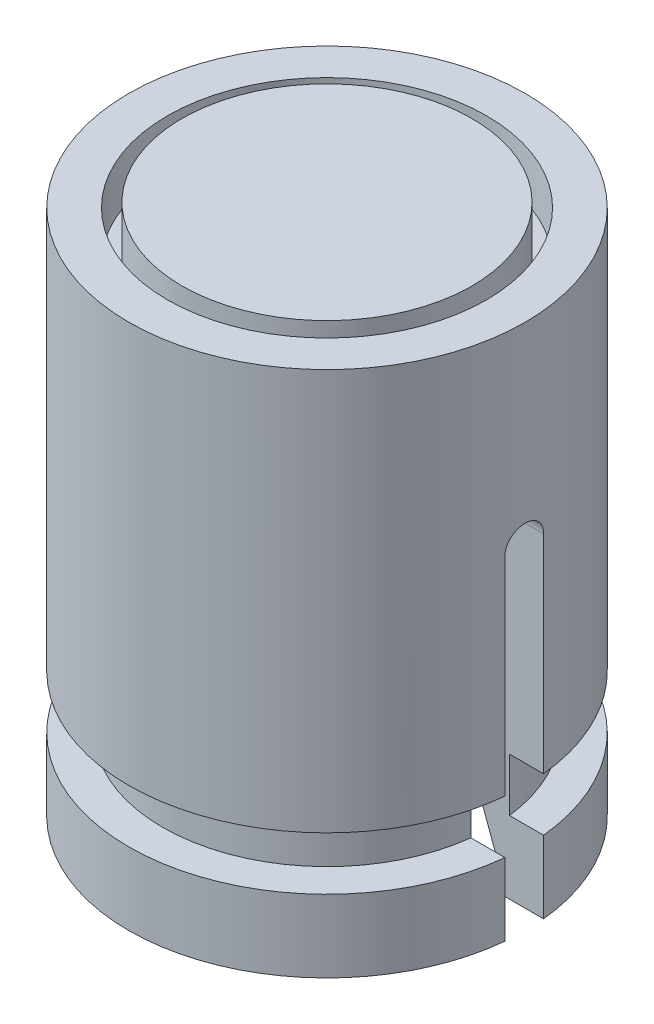
ISO-10303-21;
HEADER;
FILE_DESCRIPTION(('STEP AP214'),'2;1');
FILE_NAME('part.step','',(''),(''),'','','');
FILE_SCHEMA(('AUTOMOTIVE_DESIGN { 1 0 10303 214 1 1 1 1 }'));
ENDSEC;
DATA;
#1=APPLICATION_CONTEXT('core data for automotive mechanical design processes');
#2=APPLICATION_PROTOCOL_DEFINITION('international standard','automotive_design',2000,#1);
#3=PRODUCT_CONTEXT('',#1,'mechanical');
#4=PRODUCT('Part','Part','',(#3));
#5=PRODUCT_RELATED_PRODUCT_CATEGORY('part','',(#4));
#6=PRODUCT_DEFINITION_FORMATION('','',#4);
#7=PRODUCT_DEFINITION_CONTEXT('part definition',#1,'design');
#8=PRODUCT_DEFINITION('design','',#6,#7);
#9=PRODUCT_DEFINITION_SHAPE('','',#8);
#10=(LENGTH_UNIT() NAMED_UNIT(*) SI_UNIT(.MILLI.,.METRE.));
#11=(NAMED_UNIT(*) PLANE_ANGLE_UNIT() SI_UNIT($,.RADIAN.));
#12=(NAMED_UNIT(*) SI_UNIT($,.STERADIAN.) SOLID_ANGLE_UNIT());
#13=UNCERTAINTY_MEASURE_WITH_UNIT(LENGTH_MEASURE(1.E-05),#10,'distance_accuracy_value','');
#14=(GEOMETRIC_REPRESENTATION_CONTEXT(3) GLOBAL_UNCERTAINTY_ASSIGNED_CONTEXT((#13)) GLOBAL_UNIT_ASSIGNED_CONTEXT((#10,
#11,#12)) REPRESENTATION_CONTEXT('',''));
#15=CARTESIAN_POINT('',(0.,0.,0.));
#16=DIRECTION('',(0.,0.,1.));
#17=DIRECTION('',(1.,0.,0.));
#18=AXIS2_PLACEMENT_3D('',#15,#16,#17);
#19=CARTESIAN_POINT('',(0.,2.6,4.09999999999996));
#20=DIRECTION('',(0.,-1.,0.));
#21=DIRECTION('',(0.,0.,-1.));
#22=AXIS2_PLACEMENT_3D('',#19,#20,#21);
#23=PLANE('',#22);
#24=DIRECTION('',(-1.,0.,0.));
#25=VECTOR('',#24,1.);
#26=CARTESIAN_POINT('',(0.,2.6,0.4));
#27=LINE('',#26,#25);
#28=CARTESIAN_POINT('',(4.08044115262059,2.6,0.4));
#29=VERTEX_POINT('',#28);
#30=CARTESIAN_POINT('',(3.37638860322679,2.6,0.400000000000001));
#31=VERTEX_POINT('',#30);
#32=EDGE_CURVE('E293',#29,#31,#27,.T.);
#33=ORIENTED_EDGE('',*,*,#32,.F.);
#34=CARTESIAN_POINT('',(0.,2.6,0.));
#35=DIRECTION('',(0.,1.,0.));
#36=DIRECTION('',(0.,0.,1.));
#37=AXIS2_PLACEMENT_3D('',#34,#35,#36);
#38=CIRCLE('',#37,4.09999999999996);
#39=CARTESIAN_POINT('',(-4.08044115262059,2.6,0.4));
#40=VERTEX_POINT('',#39);
#41=EDGE_CURVE('E353',#40,#29,#38,.T.);
#42=ORIENTED_EDGE('',*,*,#41,.F.);
#43=CARTESIAN_POINT('',(-3.37638860322679,2.6,0.400000000000001));
#44=VERTEX_POINT('',#43);
#45=EDGE_CURVE('E290',#44,#40,#27,.T.);
#46=ORIENTED_EDGE('',*,*,#45,.F.);
#47=CARTESIAN_POINT('',(0.,2.6,0.));
#48=DIRECTION('',(0.,1.,0.));
#49=DIRECTION('',(0.,0.,1.));
#50=AXIS2_PLACEMENT_3D('',#47,#48,#49);
#51=CIRCLE('',#50,3.39999999999996);
#52=EDGE_CURVE('E349',#44,#31,#51,.T.);
#53=ORIENTED_EDGE('',*,*,#52,.T.);
#54=EDGE_LOOP('',(#33,#42,#46,#53));
#55=FACE_BOUND('',#54,.T.);
#56=ADVANCED_FACE('F35',(#55),#23,.T.);
#57=CARTESIAN_POINT('',(0.,0.,0.));
#58=DIRECTION('',(0.,1.,0.));
#59=DIRECTION('',(0.,0.,1.));
#60=AXIS2_PLACEMENT_3D('',#57,#58,#59);
#61=CYLINDRICAL_SURFACE('',#60,3.39999999999996);
#62=DIRECTION('',(0.,1.,0.));
#63=VECTOR('',#62,1.);
#64=CARTESIAN_POINT('',(3.37638860322679,0.,0.4));
#65=LINE('',#64,#63);
#66=CARTESIAN_POINT('',(3.37638860322679,1.5,0.4));
#67=VERTEX_POINT('',#66);
#68=EDGE_CURVE('E297',#31,#67,#65,.F.);
#69=ORIENTED_EDGE('',*,*,#68,.F.);
#70=ORIENTED_EDGE('',*,*,#52,.F.);
#71=DIRECTION('',(0.,1.,0.));
#72=VECTOR('',#71,1.);
#73=CARTESIAN_POINT('',(-3.37638860322679,0.,0.4));
#74=LINE('',#73,#72);
#75=CARTESIAN_POINT('',(-3.37638860322679,1.5,0.4));
#76=VERTEX_POINT('',#75);
#77=EDGE_CURVE('E287',#76,#44,#74,.T.);
#78=ORIENTED_EDGE('',*,*,#77,.F.);
#79=CARTESIAN_POINT('',(0.,1.5,0.));
#80=DIRECTION('',(0.,1.,0.));
#81=DIRECTION('',(0.,0.,1.));
#82=AXIS2_PLACEMENT_3D('',#79,#80,#81);
#83=CIRCLE('',#82,3.39999999999996);
#84=EDGE_CURVE('E345',#76,#67,#83,.T.);
#85=ORIENTED_EDGE('',*,*,#84,.T.);
#86=EDGE_LOOP('',(#69,#70,#78,#85));
#87=FACE_BOUND('',#86,.T.);
#88=ADVANCED_FACE('F437',(#87),#61,.T.);
#89=CARTESIAN_POINT('',(0.,1.5,3.39999999999996));
#90=DIRECTION('',(0.,1.,0.));
#91=DIRECTION('',(0.,0.,1.));
#92=AXIS2_PLACEMENT_3D('',#89,#90,#91);
#93=PLANE('',#92);
#94=DIRECTION('',(1.,0.,0.));
#95=VECTOR('',#94,1.);
#96=CARTESIAN_POINT('',(0.,1.5,0.4));
#97=LINE('',#96,#95);
#98=CARTESIAN_POINT('',(-4.08044115262059,1.5,0.400000000000001));
#99=VERTEX_POINT('',#98);
#100=EDGE_CURVE('E285',#99,#76,#97,.T.);
#101=ORIENTED_EDGE('',*,*,#100,.F.);
#102=CARTESIAN_POINT('',(0.,1.5,0.));
#103=DIRECTION('',(0.,1.,0.));
#104=DIRECTION('',(0.,0.,1.));
#105=AXIS2_PLACEMENT_3D('',#102,#103,#104);
#106=CIRCLE('',#105,4.09999999999996);
#107=CARTESIAN_POINT('',(4.08044115262059,1.5,0.400000000000001));
#108=VERTEX_POINT('',#107);
#109=EDGE_CURVE('E341',#99,#108,#106,.T.);
#110=ORIENTED_EDGE('',*,*,#109,.T.);
#111=EDGE_CURVE('E288',#67,#108,#97,.T.);
#112=ORIENTED_EDGE('',*,*,#111,.F.);
#113=ORIENTED_EDGE('',*,*,#84,.F.);
#114=EDGE_LOOP('',(#101,#110,#112,#113));
#115=FACE_BOUND('',#114,.T.);
#116=ADVANCED_FACE('F443',(#115),#93,.T.);
#117=CARTESIAN_POINT('',(0.,0.,0.));
#118=DIRECTION('',(0.,1.,0.));
#119=DIRECTION('',(0.,0.,1.));
#120=AXIS2_PLACEMENT_3D('',#117,#118,#119);
#121=CYLINDRICAL_SURFACE('',#120,4.09999999999996);
#122=DIRECTION('',(0.,1.,0.));
#123=VECTOR('',#122,1.);
#124=CARTESIAN_POINT('',(4.08044115262059,0.,0.4));
#125=LINE('',#124,#123);
#126=CARTESIAN_POINT('',(4.08044115262059,0.,0.4));
#127=VERTEX_POINT('',#126);
#128=EDGE_CURVE('E295',#108,#127,#125,.F.);
#129=ORIENTED_EDGE('',*,*,#128,.F.);
#130=ORIENTED_EDGE('',*,*,#109,.F.);
#131=DIRECTION('',(0.,1.,0.));
#132=VECTOR('',#131,1.);
#133=CARTESIAN_POINT('',(-4.08044115262059,0.,0.4));
#134=LINE('',#133,#132);
#135=CARTESIAN_POINT('',(-4.08044115262059,0.,0.4));
#136=VERTEX_POINT('',#135);
#137=EDGE_CURVE('E283',#136,#99,#134,.T.);
#138=ORIENTED_EDGE('',*,*,#137,.F.);
#139=CARTESIAN_POINT('',(0.,0.,0.));
#140=DIRECTION('',(0.,1.,0.));
#141=DIRECTION('',(0.,0.,1.));
#142=AXIS2_PLACEMENT_3D('',#139,#140,#141);
#143=CIRCLE('',#142,4.09999999999996);
#144=EDGE_CURVE('E337',#136,#127,#143,.T.);
#145=ORIENTED_EDGE('',*,*,#144,.T.);
#146=EDGE_LOOP('',(#129,#130,#138,#145));
#147=FACE_BOUND('',#146,.T.);
#148=ADVANCED_FACE('F460',(#147),#121,.T.);
#149=CARTESIAN_POINT('',(0.,0.,3.1428478683667));
#150=DIRECTION('',(0.,-1.,0.));
#151=DIRECTION('',(0.,0.,-1.));
#152=AXIS2_PLACEMENT_3D('',#149,#150,#151);
#153=PLANE('',#152);
#154=DIRECTION('',(1.,0.,0.));
#155=VECTOR('',#154,1.);
#156=CARTESIAN_POINT('',(-4.09999999999996,0.,0.4));
#157=LINE('',#156,#155);
#158=CARTESIAN_POINT('',(3.11728932306533,0.,0.4));
#159=VERTEX_POINT('',#158);
#160=EDGE_CURVE('E381',#159,#127,#157,.T.);
#161=ORIENTED_EDGE('',*,*,#160,.T.);
#162=ORIENTED_EDGE('',*,*,#144,.F.);
#163=CARTESIAN_POINT('',(-3.11728932306533,0.,0.4));
#164=VERTEX_POINT('',#163);
#165=EDGE_CURVE('E379',#136,#164,#157,.T.);
#166=ORIENTED_EDGE('',*,*,#165,.T.);
#167=CARTESIAN_POINT('',(0.,0.,0.));
#168=DIRECTION('',(0.,1.,0.));
#169=DIRECTION('',(0.,0.,1.));
#170=AXIS2_PLACEMENT_3D('',#167,#168,#169);
#171=CIRCLE('',#170,3.1428478683667);
#172=EDGE_CURVE('E333',#164,#159,#171,.T.);
#173=ORIENTED_EDGE('',*,*,#172,.T.);
#174=EDGE_LOOP('',(#161,#162,#166,#173));
#175=FACE_BOUND('',#174,.T.);
#176=ADVANCED_FACE('F462',(#175),#153,.T.);
#177=CARTESIAN_POINT('',(0.,0.,0.));
#178=DIRECTION('',(0.,1.,0.));
#179=DIRECTION('',(0.,0.,1.));
#180=AXIS2_PLACEMENT_3D('',#177,#178,#179);
#181=CYLINDRICAL_SURFACE('',#180,3.1428478683667);
#182=DIRECTION('',(0.,1.,0.));
#183=VECTOR('',#182,1.);
#184=CARTESIAN_POINT('',(3.11728932306533,0.,0.4));
#185=LINE('',#184,#183);
#186=CARTESIAN_POINT('',(3.11728932306533,0.600000000000001,0.4));
#187=VERTEX_POINT('',#186);
#188=EDGE_CURVE('E281',#159,#187,#185,.T.);
#189=ORIENTED_EDGE('',*,*,#188,.F.);
#190=ORIENTED_EDGE('',*,*,#172,.F.);
#191=DIRECTION('',(0.,1.,0.));
#192=VECTOR('',#191,1.);
#193=CARTESIAN_POINT('',(-3.11728932306533,0.,0.4));
#194=LINE('',#193,#192);
#195=CARTESIAN_POINT('',(-3.11728932306533,0.600000000000001,0.4));
#196=VERTEX_POINT('',#195);
#197=EDGE_CURVE('E275',#196,#164,#194,.F.);
#198=ORIENTED_EDGE('',*,*,#197,.F.);
#199=CARTESIAN_POINT('',(0.,0.600000000000001,0.));
#200=DIRECTION('',(0.,1.,0.));
#201=DIRECTION('',(0.,0.,1.));
#202=AXIS2_PLACEMENT_3D('',#199,#200,#201);
#203=CIRCLE('',#202,3.1428478683667);
#204=EDGE_CURVE('E329',#196,#187,#203,.T.);
#205=ORIENTED_EDGE('',*,*,#204,.T.);
#206=EDGE_LOOP('',(#189,#190,#198,#205));
#207=FACE_BOUND('',#206,.T.);
#208=ADVANCED_FACE('F465',(#207),#181,.F.);
#209=CARTESIAN_POINT('',(0.,0.600000000000001,0.));
#210=DIRECTION('',(0.,-1.,0.));
#211=DIRECTION('',(0.,0.,-1.));
#212=AXIS2_PLACEMENT_3D('',#209,#210,#211);
#213=CONICAL_SURFACE('',#212,3.1428478683667,0.349065850398866);
#214=CARTESIAN_POINT('',(-1.38024996298594,5.28666286579078,0.4));
#215=CARTESIAN_POINT('',(-1.44348043899883,5.11976848714253,0.4));
#216=CARTESIAN_POINT('',(-1.50644161599179,4.95277252065579,0.4));
#217=CARTESIAN_POINT('',(-1.63195541761176,4.61862750786504,0.4));
#218=CARTESIAN_POINT('',(-1.69450804318998,4.45147846191846,0.4));
#219=CARTESIAN_POINT('',(-1.88174795456437,3.94987741004987,0.4));
#220=CARTESIAN_POINT('',(-2.00601792606068,3.61526976351667,0.4));
#221=CARTESIAN_POINT('',(-2.25823416958317,2.93420645404892,0.4));
#222=CARTESIAN_POINT('',(-2.38615835100178,2.58774262244609,0.4));
#223=CARTESIAN_POINT('',(-2.64159132362518,1.89466077289493,0.4));
#224=CARTESIAN_POINT('',(-2.76910011361758,1.54804275449992,0.4));
#225=CARTESIAN_POINT('',(-3.14695312165465,0.519672979172082,0.4));
#226=CARTESIAN_POINT('',(-3.39691531953433,-0.162219095155178,0.4));
#227=CARTESIAN_POINT('',(-3.77147553597626,-1.18519442774862,0.4));
#228=CARTESIAN_POINT('',(-3.89626462886912,-1.52620780019105,0.4));
#229=CARTESIAN_POINT('',(-4.14574158465288,-2.20827149679332,0.4));
#230=CARTESIAN_POINT('',(-4.27042944756379,-2.54932182094583,0.4));
#231=CARTESIAN_POINT('',(-4.39507979531478,-2.89038586941088,0.4));
#232=B_SPLINE_CURVE_WITH_KNOTS('',3,(#214,#215,#216,#217,#218,#219,#220,#221,#222,#223,#224,
#225,#226,#227,#228,#229,#230,#231),.UNSPECIFIED.,.F.,.F.,(4,2,2,2,2,2,2,2,4),(0.,
0.535411577346744,1.07082190768278,2.14163703262702,3.24961506967415,4.35759633762485,
6.53638471469842,7.62577075704803,8.71515658406538),.UNSPECIFIED.);
#233=CARTESIAN_POINT('',(-2.82179021190449,1.40459290567293,0.400000000000001));
#234=VERTEX_POINT('',#233);
#235=EDGE_CURVE('E183',#234,#196,#232,.T.);
#236=ORIENTED_EDGE('',*,*,#235,.F.);
#237=CARTESIAN_POINT('',(0.,1.40459290567293,0.));
#238=DIRECTION('',(0.,1.,0.));
#239=DIRECTION('',(0.,0.,1.));
#240=AXIS2_PLACEMENT_3D('',#237,#238,#239);
#241=CIRCLE('',#240,2.85);
#242=CARTESIAN_POINT('',(2.82179021190449,1.40459290567293,0.400000000000001));
#243=VERTEX_POINT('',#242);
#244=EDGE_CURVE('E325',#234,#243,#241,.T.);
#245=ORIENTED_EDGE('',*,*,#244,.T.);
#246=CARTESIAN_POINT('',(4.39507979531478,-2.89038586941088,0.4));
#247=CARTESIAN_POINT('',(4.14575449465346,-2.20826201488483,0.4));
#248=CARTESIAN_POINT('',(3.89632508604677,-1.52617604261783,0.4));
#249=CARTESIAN_POINT('',(3.52176527888476,-0.503201277620822,0.4));
#250=CARTESIAN_POINT('',(3.39684304160076,-0.162236244005311,0.4));
#251=CARTESIAN_POINT('',(3.14681635928145,0.519627261747408,0.4));
#252=CARTESIAN_POINT('',(3.02171191413509,0.860525733843911,0.4));
#253=CARTESIAN_POINT('',(2.77123852428185,1.54222821009942,0.4));
#254=CARTESIAN_POINT('',(2.64586957775043,1.88303221358831,0.4));
#255=CARTESIAN_POINT('',(2.39473395982748,2.5644931351665,0.4));
#256=CARTESIAN_POINT('',(2.26896728900369,2.90515005346496,0.4));
#257=CARTESIAN_POINT('',(2.01679688123559,3.58623068089252,0.4));
#258=CARTESIAN_POINT('',(1.89039314049897,3.92665438861963,0.4));
#259=CARTESIAN_POINT('',(1.69993379070075,4.43697253021622,0.4));
#260=CARTESIAN_POINT('',(1.63630489823271,4.60702607922911,0.4));
#261=CARTESIAN_POINT('',(1.50862667467155,4.94697566658211,0.4));
#262=CARTESIAN_POINT('',(1.44457734257815,5.11687170454638,0.4));
#263=CARTESIAN_POINT('',(1.38024996298594,5.28666286579078,0.4));
#264=B_SPLINE_CURVE_WITH_KNOTS('',3,(#246,#247,#248,#249,#250,#251,#252,#253,#254,#255,#256,
#257,#258,#259,#260,#261,#262,#263),.UNSPECIFIED.,.F.,.F.,(4,2,2,2,2,2,2,2,4),(0.,
2.17878529070714,3.26817246615232,4.35756030570309,5.44695568456568,6.53634950905689,
7.62574982611277,8.1704525825404,8.71515663536816),.UNSPECIFIED.);
#265=EDGE_CURVE('E276',#187,#243,#264,.T.);
#266=ORIENTED_EDGE('',*,*,#265,.F.);
#267=ORIENTED_EDGE('',*,*,#204,.F.);
#268=EDGE_LOOP('',(#236,#245,#266,#267));
#269=FACE_BOUND('',#268,.T.);
#270=ADVANCED_FACE('F253',(#269),#213,.F.);
#271=CARTESIAN_POINT('',(0.,0.,0.));
#272=DIRECTION('',(0.,1.,0.));
#273=DIRECTION('',(0.,0.,1.));
#274=AXIS2_PLACEMENT_3D('',#271,#272,#273);
#275=CYLINDRICAL_SURFACE('',#274,4.09999999999996);
#276=DIRECTION('',(0.,1.,0.));
#277=VECTOR('',#276,1.);
#278=CARTESIAN_POINT('',(-4.08044115262059,0.,0.4));
#279=LINE('',#278,#277);
#280=CARTESIAN_POINT('',(-4.08044115262059,6.9,0.4));
#281=VERTEX_POINT('',#280);
#282=EDGE_CURVE('E292',#40,#281,#279,.T.);
#283=ORIENTED_EDGE('',*,*,#282,.F.);
#284=ORIENTED_EDGE('',*,*,#41,.T.);
#285=DIRECTION('',(0.,1.,0.));
#286=VECTOR('',#285,1.);
#287=CARTESIAN_POINT('',(4.08044115262059,0.,0.4));
#288=LINE('',#287,#286);
#289=CARTESIAN_POINT('',(4.08044115262059,6.9,0.4));
#290=VERTEX_POINT('',#289);
#291=EDGE_CURVE('E299',#290,#29,#288,.F.);
#292=ORIENTED_EDGE('',*,*,#291,.F.);
#293=CARTESIAN_POINT('',(4.08044115262059,6.9,-0.4));
#294=CARTESIAN_POINT('',(4.08043397861518,6.92244627075559,-0.400019363787714));
#295=CARTESIAN_POINT('',(4.08062616772674,6.94488562327999,-0.398111805564599));
#296=CARTESIAN_POINT('',(4.08135607066033,6.98910724663271,-0.390587071763259));
#297=CARTESIAN_POINT('',(4.081893462736,7.01089010956999,-0.384973350378541));
#298=CARTESIAN_POINT('',(4.08326101415618,7.05320766615992,-0.370177207983112));
#299=CARTESIAN_POINT('',(4.08409128497163,7.07374188107803,-0.360993428056321));
#300=CARTESIAN_POINT('',(4.08594851288664,7.11297544475612,-0.339327719685698));
#301=CARTESIAN_POINT('',(4.08697544556576,7.13167502089627,-0.326846200664642));
#302=CARTESIAN_POINT('',(4.08911474481273,7.16677338091867,-0.298892719026805));
#303=CARTESIAN_POINT('',(4.09022735768318,7.18316511715584,-0.283411925240109));
#304=CARTESIAN_POINT('',(4.09241039875222,7.21312395132327,-0.249916629049021));
#305=CARTESIAN_POINT('',(4.09348082050729,7.22669061914789,-0.231901741537258));
#306=CARTESIAN_POINT('',(4.09546124348971,7.25063657671466,-0.193806928369867));
#307=CARTESIAN_POINT('',(4.09637092440606,7.26100953214458,-0.173723002948535));
#308=CARTESIAN_POINT('',(4.09792458075149,7.27823252944675,-0.13208931593612));
#309=CARTESIAN_POINT('',(4.09856857838229,7.28508286569716,-0.110539677002222));
#310=CARTESIAN_POINT('',(4.09951662439642,7.29504596385037,-0.0666579936018369));
#311=CARTESIAN_POINT('',(4.0998217492863,7.29817056374723,-0.0443286605257434));
#312=CARTESIAN_POINT('',(4.10006133229449,7.30063013204202,0.000539981547823525));
#313=CARTESIAN_POINT('',(4.09999579053452,7.29996510168431,0.0230792904763467));
#314=CARTESIAN_POINT('',(4.09950229382432,7.29487377290793,0.0676465005060284));
#315=CARTESIAN_POINT('',(4.09907557591886,7.29046031285454,0.0896758838657033));
#316=CARTESIAN_POINT('',(4.09790911537951,7.27801742223316,0.132679621293858));
#317=CARTESIAN_POINT('',(4.09716937040287,7.26998796460246,0.153653967464964));
#318=CARTESIAN_POINT('',(4.09545788755728,7.25052670326444,0.19399328893237));
#319=CARTESIAN_POINT('',(4.09448575748007,7.23908913938885,0.213355467988537));
#320=CARTESIAN_POINT('',(4.09241868001366,7.21314108707264,0.249889317939675));
#321=CARTESIAN_POINT('',(4.09132373470004,7.19863065056023,0.267061025843381));
#322=CARTESIAN_POINT('',(4.08912862066103,7.16687862268773,0.298800503279593));
#323=CARTESIAN_POINT('',(4.08802844868909,7.14962624529471,0.313357484171751));
#324=CARTESIAN_POINT('',(4.0859510448582,7.11291106178703,0.339374650429137));
#325=CARTESIAN_POINT('',(4.08497385051725,7.09344758453973,0.350833891954977));
#326=CARTESIAN_POINT('',(4.08325245974735,7.05284861321619,0.370331099039042));
#327=CARTESIAN_POINT('',(4.08250844785446,7.03171181138857,0.378366356722122));
#328=CARTESIAN_POINT('',(4.08134185840146,6.98840594804079,0.39075533489957));
#329=CARTESIAN_POINT('',(4.08091879449718,6.96623850261353,0.395114626841295));
#330=CARTESIAN_POINT('',(4.08051948342636,6.92930186817745,0.399197205935885));
#331=CARTESIAN_POINT('',(4.08043889016785,6.91464733686135,0.400006826604937));
#332=CARTESIAN_POINT('',(4.08044115262059,6.9,0.4));
#333=B_SPLINE_CURVE_WITH_KNOTS('',3,(#293,#294,#295,#296,#297,#298,#299,#300,#301,#302,#303,
#304,#305,#306,#307,#308,#309,#310,#311,#312,#313,#314,#315,#316,#317,#318,#319,#320,#321,#322,
#323,#324,#325,#326,#327,#328,#329,#330,#331,#332),.UNSPECIFIED.,.F.,.F.,(4,2,2,2,2,2,2,2,2,2,2,
2,2,2,2,2,2,2,2,4),(0.,0.0672469555086013,0.134431324270237,0.201641291339745,0.268842918037096,
0.336245508241953,0.403658352737596,0.47120405309129,0.53874410786963,0.606068987032718,
0.673393844089,0.740489039210387,0.807584736491332,0.874794484233034,0.942003096293382,
1.00948294834481,1.07698333748228,1.14453701101563,1.21198811240162,1.25592694482352),.UNSPECIFIED.);
#334=CARTESIAN_POINT('',(4.08044115262059,6.9,-0.4));
#335=VERTEX_POINT('',#334);
#336=EDGE_CURVE('E184',#335,#290,#333,.T.);
#337=ORIENTED_EDGE('',*,*,#336,.F.);
#338=DIRECTION('',(0.,1.,0.));
#339=VECTOR('',#338,1.);
#340=CARTESIAN_POINT('',(4.08044115262059,0.,-0.4));
#341=LINE('',#340,#339);
#342=CARTESIAN_POINT('',(4.08044115262059,2.6,-0.4));
#343=VERTEX_POINT('',#342);
#344=EDGE_CURVE('E416',#343,#335,#341,.T.);
#345=ORIENTED_EDGE('',*,*,#344,.F.);
#346=CARTESIAN_POINT('',(-4.08044115262059,2.6,-0.4));
#347=VERTEX_POINT('',#346);
#348=EDGE_CURVE('E196',#343,#347,#38,.T.);
#349=ORIENTED_EDGE('',*,*,#348,.T.);
#350=DIRECTION('',(0.,1.,0.));
#351=VECTOR('',#350,1.);
#352=CARTESIAN_POINT('',(-4.08044115262059,0.,-0.4));
#353=LINE('',#352,#351);
#354=CARTESIAN_POINT('',(-4.08044115262059,6.9,-0.4));
#355=VERTEX_POINT('',#354);
#356=EDGE_CURVE('E187',#355,#347,#353,.F.);
#357=ORIENTED_EDGE('',*,*,#356,.F.);
#358=CARTESIAN_POINT('',(-4.08044115262059,6.9,0.4));
#359=CARTESIAN_POINT('',(-4.08043397861518,6.92244627075559,0.400019363787714));
#360=CARTESIAN_POINT('',(-4.08062616772674,6.94488562327999,0.398111805564599));
#361=CARTESIAN_POINT('',(-4.08135607066033,6.98910724663271,0.390587071763259));
#362=CARTESIAN_POINT('',(-4.081893462736,7.01089010956999,0.384973350378541));
#363=CARTESIAN_POINT('',(-4.08326101415618,7.05320766615992,0.370177207983112));
#364=CARTESIAN_POINT('',(-4.08409128497163,7.07374188107803,0.360993428056321));
#365=CARTESIAN_POINT('',(-4.08594851288664,7.11297544475612,0.339327719685698));
#366=CARTESIAN_POINT('',(-4.08697544556576,7.13167502089627,0.326846200664642));
#367=CARTESIAN_POINT('',(-4.08911474481273,7.16677338091867,0.298892719026805));
#368=CARTESIAN_POINT('',(-4.09022735768318,7.18316511715584,0.283411925240108));
#369=CARTESIAN_POINT('',(-4.09241039875222,7.21312395132327,0.249916629049021));
#370=CARTESIAN_POINT('',(-4.09348082050729,7.22669061914789,0.231901741537258));
#371=CARTESIAN_POINT('',(-4.09546124348971,7.25063657671466,0.193806928369867));
#372=CARTESIAN_POINT('',(-4.09637092440607,7.26100953214458,0.173723002948535));
#373=CARTESIAN_POINT('',(-4.09792458075149,7.27823252944675,0.13208931593612));
#374=CARTESIAN_POINT('',(-4.09856857838229,7.28508286569716,0.110539677002222));
#375=CARTESIAN_POINT('',(-4.09951662439642,7.29504596385037,0.066657993601837));
#376=CARTESIAN_POINT('',(-4.0998217492863,7.29817056374723,0.0443286605257434));
#377=CARTESIAN_POINT('',(-4.10006133229449,7.30063013204202,-0.000539981547823478));
#378=CARTESIAN_POINT('',(-4.09999579053452,7.29996510168431,-0.0230792904763467));
#379=CARTESIAN_POINT('',(-4.09950229382432,7.29487377290793,-0.0676465005060283));
#380=CARTESIAN_POINT('',(-4.09907557591886,7.29046031285454,-0.0896758838657033));
#381=CARTESIAN_POINT('',(-4.09790911537951,7.27801742223316,-0.132679621293858));
#382=CARTESIAN_POINT('',(-4.09716937040287,7.26998796460246,-0.153653967464964));
#383=CARTESIAN_POINT('',(-4.09545788755728,7.25052670326444,-0.19399328893237));
#384=CARTESIAN_POINT('',(-4.09448575748007,7.23908913938885,-0.213355467988537));
#385=CARTESIAN_POINT('',(-4.09241868001366,7.21314108707264,-0.249889317939675));
#386=CARTESIAN_POINT('',(-4.09132373470004,7.19863065056023,-0.267061025843381));
#387=CARTESIAN_POINT('',(-4.08912862066103,7.16687862268773,-0.298800503279593));
#388=CARTESIAN_POINT('',(-4.08802844868908,7.14962624529471,-0.313357484171751));
#389=CARTESIAN_POINT('',(-4.0859510448582,7.11291106178703,-0.339374650429137));
#390=CARTESIAN_POINT('',(-4.08497385051725,7.09344758453973,-0.350833891954977));
#391=CARTESIAN_POINT('',(-4.08325245974735,7.05284861321619,-0.370331099039042));
#392=CARTESIAN_POINT('',(-4.08250844785446,7.03171181138857,-0.378366356722122));
#393=CARTESIAN_POINT('',(-4.08134185840146,6.98840594804079,-0.39075533489957));
#394=CARTESIAN_POINT('',(-4.08091879449718,6.96623850261353,-0.395114626841295));
#395=CARTESIAN_POINT('',(-4.08051948342636,6.92930186817745,-0.399197205935886));
#396=CARTESIAN_POINT('',(-4.08043889016785,6.91464733686136,-0.400006826604937));
#397=CARTESIAN_POINT('',(-4.08044115262059,6.9,-0.4));
#398=B_SPLINE_CURVE_WITH_KNOTS('',3,(#358,#359,#360,#361,#362,#363,#364,#365,#366,#367,#368,
#369,#370,#371,#372,#373,#374,#375,#376,#377,#378,#379,#380,#381,#382,#383,#384,#385,#386,#387,
#388,#389,#390,#391,#392,#393,#394,#395,#396,#397),.UNSPECIFIED.,.F.,.F.,(4,2,2,2,2,2,2,2,2,2,2,
2,2,2,2,2,2,2,2,4),(0.,0.0672469555086013,0.134431324270237,0.201641291339745,0.268842918037096,
0.336245508241953,0.403658352737596,0.47120405309129,0.53874410786963,0.606068987032717,
0.673393844089,0.740489039210387,0.807584736491332,0.874794484233034,0.942003096293382,
1.00948294834481,1.07698333748228,1.14453701101563,1.21198811240162,1.25592694482352),.UNSPECIFIED.);
#399=EDGE_CURVE('E173',#281,#355,#398,.T.);
#400=ORIENTED_EDGE('',*,*,#399,.F.);
#401=EDGE_LOOP('',(#283,#284,#292,#337,#345,#349,#357,#400));
#402=FACE_BOUND('',#401,.T.);
#403=CARTESIAN_POINT('',(0.,10.9,0.));
#404=DIRECTION('',(0.,1.,0.));
#405=DIRECTION('',(0.,0.,1.));
#406=AXIS2_PLACEMENT_3D('',#403,#404,#405);
#407=CIRCLE('',#406,4.09999999999996);
#408=CARTESIAN_POINT('',(0.,10.9,4.09999999999996));
#409=VERTEX_POINT('',#408);
#410=EDGE_CURVE('E301',#409,#409,#407,.T.);
#411=ORIENTED_EDGE('',*,*,#410,.F.);
#412=EDGE_LOOP('',(#411));
#413=FACE_BOUND('',#412,.T.);
#414=ADVANCED_FACE('F37',(#402,#413),#275,.T.);
#415=DIRECTION('',(1.,0.,0.));
#416=VECTOR('',#415,1.);
#417=CARTESIAN_POINT('',(0.,2.6,-0.4));
#418=LINE('',#417,#416);
#419=CARTESIAN_POINT('',(-3.37638860322679,2.6,-0.399999999999999));
#420=VERTEX_POINT('',#419);
#421=EDGE_CURVE('E197',#347,#420,#418,.T.);
#422=ORIENTED_EDGE('',*,*,#421,.F.);
#423=ORIENTED_EDGE('',*,*,#348,.F.);
#424=CARTESIAN_POINT('',(3.37638860322679,2.6,-0.399999999999999));
#425=VERTEX_POINT('',#424);
#426=EDGE_CURVE('E202',#425,#343,#418,.T.);
#427=ORIENTED_EDGE('',*,*,#426,.F.);
#428=EDGE_CURVE('E352',#425,#420,#51,.T.);
#429=ORIENTED_EDGE('',*,*,#428,.T.);
#430=EDGE_LOOP('',(#422,#423,#427,#429));
#431=FACE_BOUND('',#430,.T.);
#432=ADVANCED_FACE('F430',(#431),#23,.T.);
#433=DIRECTION('',(0.,1.,0.));
#434=VECTOR('',#433,1.);
#435=CARTESIAN_POINT('',(-3.37638860322679,0.,-0.4));
#436=LINE('',#435,#434);
#437=CARTESIAN_POINT('',(-3.37638860322679,1.5,-0.4));
#438=VERTEX_POINT('',#437);
#439=EDGE_CURVE('E200',#420,#438,#436,.F.);
#440=ORIENTED_EDGE('',*,*,#439,.F.);
#441=ORIENTED_EDGE('',*,*,#428,.F.);
#442=DIRECTION('',(0.,1.,0.));
#443=VECTOR('',#442,1.);
#444=CARTESIAN_POINT('',(3.37638860322679,0.,-0.4));
#445=LINE('',#444,#443);
#446=CARTESIAN_POINT('',(3.37638860322679,1.5,-0.4));
#447=VERTEX_POINT('',#446);
#448=EDGE_CURVE('E411',#447,#425,#445,.T.);
#449=ORIENTED_EDGE('',*,*,#448,.F.);
#450=EDGE_CURVE('E348',#447,#438,#83,.T.);
#451=ORIENTED_EDGE('',*,*,#450,.T.);
#452=EDGE_LOOP('',(#440,#441,#449,#451));
#453=FACE_BOUND('',#452,.T.);
#454=ADVANCED_FACE('F427',(#453),#61,.T.);
#455=DIRECTION('',(-1.,0.,0.));
#456=VECTOR('',#455,1.);
#457=CARTESIAN_POINT('',(0.,1.5,-0.4));
#458=LINE('',#457,#456);
#459=CARTESIAN_POINT('',(4.08044115262059,1.5,-0.399999999999999));
#460=VERTEX_POINT('',#459);
#461=EDGE_CURVE('E409',#460,#447,#458,.T.);
#462=ORIENTED_EDGE('',*,*,#461,.F.);
#463=CARTESIAN_POINT('',(-4.08044115262059,1.5,-0.399999999999999));
#464=VERTEX_POINT('',#463);
#465=EDGE_CURVE('E344',#460,#464,#106,.T.);
#466=ORIENTED_EDGE('',*,*,#465,.T.);
#467=EDGE_CURVE('E413',#438,#464,#458,.T.);
#468=ORIENTED_EDGE('',*,*,#467,.F.);
#469=ORIENTED_EDGE('',*,*,#450,.F.);
#470=EDGE_LOOP('',(#462,#466,#468,#469));
#471=FACE_BOUND('',#470,.T.);
#472=ADVANCED_FACE('F425',(#471),#93,.T.);
#473=DIRECTION('',(0.,1.,0.));
#474=VECTOR('',#473,1.);
#475=CARTESIAN_POINT('',(-4.08044115262059,0.,-0.4));
#476=LINE('',#475,#474);
#477=CARTESIAN_POINT('',(-4.08044115262059,0.,-0.4));
#478=VERTEX_POINT('',#477);
#479=EDGE_CURVE('E395',#464,#478,#476,.F.);
#480=ORIENTED_EDGE('',*,*,#479,.F.);
#481=ORIENTED_EDGE('',*,*,#465,.F.);
#482=DIRECTION('',(0.,1.,0.));
#483=VECTOR('',#482,1.);
#484=CARTESIAN_POINT('',(4.08044115262059,0.,-0.4));
#485=LINE('',#484,#483);
#486=CARTESIAN_POINT('',(4.08044115262059,0.,-0.4));
#487=VERTEX_POINT('',#486);
#488=EDGE_CURVE('E402',#487,#460,#485,.T.);
#489=ORIENTED_EDGE('',*,*,#488,.F.);
#490=EDGE_CURVE('E340',#487,#478,#143,.T.);
#491=ORIENTED_EDGE('',*,*,#490,.T.);
#492=EDGE_LOOP('',(#480,#481,#489,#491));
#493=FACE_BOUND('',#492,.T.);
#494=ADVANCED_FACE('F405',(#493),#121,.T.);
#495=DIRECTION('',(1.,0.,0.));
#496=VECTOR('',#495,1.);
#497=CARTESIAN_POINT('',(-4.09999999999996,0.,-0.4));
#498=LINE('',#497,#496);
#499=CARTESIAN_POINT('',(-3.11728932306533,0.,-0.4));
#500=VERTEX_POINT('',#499);
#501=EDGE_CURVE('E387',#478,#500,#498,.T.);
#502=ORIENTED_EDGE('',*,*,#501,.F.);
#503=ORIENTED_EDGE('',*,*,#490,.F.);
#504=CARTESIAN_POINT('',(3.11728932306533,0.,-0.4));
#505=VERTEX_POINT('',#504);
#506=EDGE_CURVE('E388',#505,#487,#498,.T.);
#507=ORIENTED_EDGE('',*,*,#506,.F.);
#508=EDGE_CURVE('E336',#505,#500,#171,.T.);
#509=ORIENTED_EDGE('',*,*,#508,.T.);
#510=EDGE_LOOP('',(#502,#503,#507,#509));
#511=FACE_BOUND('',#510,.T.);
#512=ADVANCED_FACE('F403',(#511),#153,.T.);
#513=DIRECTION('',(0.,1.,0.));
#514=VECTOR('',#513,1.);
#515=CARTESIAN_POINT('',(-3.11728932306533,0.,-0.4));
#516=LINE('',#515,#514);
#517=CARTESIAN_POINT('',(-3.11728932306533,0.600000000000001,-0.4));
#518=VERTEX_POINT('',#517);
#519=EDGE_CURVE('E393',#500,#518,#516,.T.);
#520=ORIENTED_EDGE('',*,*,#519,.F.);
#521=ORIENTED_EDGE('',*,*,#508,.F.);
#522=DIRECTION('',(0.,1.,0.));
#523=VECTOR('',#522,1.);
#524=CARTESIAN_POINT('',(3.11728932306533,0.,-0.4));
#525=LINE('',#524,#523);
#526=CARTESIAN_POINT('',(3.11728932306533,0.600000000000001,-0.4));
#527=VERTEX_POINT('',#526);
#528=EDGE_CURVE('E378',#527,#505,#525,.F.);
#529=ORIENTED_EDGE('',*,*,#528,.F.);
#530=EDGE_CURVE('E332',#527,#518,#203,.T.);
#531=ORIENTED_EDGE('',*,*,#530,.T.);
#532=EDGE_LOOP('',(#520,#521,#529,#531));
#533=FACE_BOUND('',#532,.T.);
#534=ADVANCED_FACE('F251',(#533),#181,.F.);
#535=CARTESIAN_POINT('',(-4.39507979531478,-2.89038586941088,-0.4));
#536=CARTESIAN_POINT('',(-4.14575449465346,-2.20826201488483,-0.4));
#537=CARTESIAN_POINT('',(-3.89632508604677,-1.52617604261783,-0.4));
#538=CARTESIAN_POINT('',(-3.52176527888476,-0.503201277620822,-0.4));
#539=CARTESIAN_POINT('',(-3.39684304160076,-0.162236244005311,-0.4));
#540=CARTESIAN_POINT('',(-3.14681635928145,0.519627261747408,-0.4));
#541=CARTESIAN_POINT('',(-3.02171191413509,0.860525733843911,-0.4));
#542=CARTESIAN_POINT('',(-2.77123852428185,1.54222821009942,-0.4));
#543=CARTESIAN_POINT('',(-2.64586957775043,1.88303221358831,-0.4));
#544=CARTESIAN_POINT('',(-2.39473395982748,2.5644931351665,-0.4));
#545=CARTESIAN_POINT('',(-2.26896728900369,2.90515005346496,-0.4));
#546=CARTESIAN_POINT('',(-2.01679688123559,3.58623068089252,-0.4));
#547=CARTESIAN_POINT('',(-1.89039314049897,3.92665438861963,-0.4));
#548=CARTESIAN_POINT('',(-1.69993379070075,4.43697253021622,-0.4));
#549=CARTESIAN_POINT('',(-1.63630489823271,4.60702607922911,-0.4));
#550=CARTESIAN_POINT('',(-1.50862667467155,4.94697566658211,-0.4));
#551=CARTESIAN_POINT('',(-1.44457734257815,5.11687170454638,-0.4));
#552=CARTESIAN_POINT('',(-1.38024996298594,5.28666286579078,-0.4));
#553=B_SPLINE_CURVE_WITH_KNOTS('',3,(#535,#536,#537,#538,#539,#540,#541,#542,#543,#544,#545,
#546,#547,#548,#549,#550,#551,#552),.UNSPECIFIED.,.F.,.F.,(4,2,2,2,2,2,2,2,4),(0.,
2.17878529070714,3.26817246615232,4.35756030570309,5.44695568456568,6.53634950905689,
7.62574982611277,8.1704525825404,8.71515663536816),.UNSPECIFIED.);
#554=CARTESIAN_POINT('',(-2.82179021190449,1.40459290567293,-0.399999999999998));
#555=VERTEX_POINT('',#554);
#556=EDGE_CURVE('E59',#518,#555,#553,.T.);
#557=ORIENTED_EDGE('',*,*,#556,.F.);
#558=ORIENTED_EDGE('',*,*,#530,.F.);
#559=CARTESIAN_POINT('',(1.38024996298594,5.28666286579078,-0.4));
#560=CARTESIAN_POINT('',(1.44348043899883,5.11976848714252,-0.4));
#561=CARTESIAN_POINT('',(1.50644161599179,4.95277252065579,-0.4));
#562=CARTESIAN_POINT('',(1.63195541761176,4.61862750786504,-0.4));
#563=CARTESIAN_POINT('',(1.69450804318998,4.45147846191846,-0.4));
#564=CARTESIAN_POINT('',(1.88174795456437,3.94987741004987,-0.4));
#565=CARTESIAN_POINT('',(2.00601792606068,3.61526976351667,-0.4));
#566=CARTESIAN_POINT('',(2.25823416958317,2.93420645404892,-0.4));
#567=CARTESIAN_POINT('',(2.38615835100178,2.5877426224461,-0.4));
#568=CARTESIAN_POINT('',(2.64159132362518,1.89466077289493,-0.4));
#569=CARTESIAN_POINT('',(2.76910011361758,1.54804275449992,-0.4));
#570=CARTESIAN_POINT('',(3.14695312165465,0.519672979172083,-0.4));
#571=CARTESIAN_POINT('',(3.39691531953433,-0.162219095155177,-0.4));
#572=CARTESIAN_POINT('',(3.77147553597626,-1.18519442774861,-0.4));
#573=CARTESIAN_POINT('',(3.89626462886912,-1.52620780019105,-0.4));
#574=CARTESIAN_POINT('',(4.14574158465288,-2.20827149679331,-0.4));
#575=CARTESIAN_POINT('',(4.27042944756379,-2.54932182094583,-0.4));
#576=CARTESIAN_POINT('',(4.39507979531478,-2.89038586941088,-0.4));
#577=B_SPLINE_CURVE_WITH_KNOTS('',3,(#559,#560,#561,#562,#563,#564,#565,#566,#567,#568,#569,
#570,#571,#572,#573,#574,#575,#576),.UNSPECIFIED.,.F.,.F.,(4,2,2,2,2,2,2,2,4),(0.,
0.535411577346744,1.07082190768278,2.14163703262702,3.24961506967415,4.35759633762485,
6.53638471469842,7.62577075704803,8.71515658406537),.UNSPECIFIED.);
#578=CARTESIAN_POINT('',(2.82179021190449,1.40459290567293,-0.399999999999999));
#579=VERTEX_POINT('',#578);
#580=EDGE_CURVE('E258',#579,#527,#577,.T.);
#581=ORIENTED_EDGE('',*,*,#580,.F.);
#582=EDGE_CURVE('E328',#579,#555,#241,.T.);
#583=ORIENTED_EDGE('',*,*,#582,.T.);
#584=EDGE_LOOP('',(#557,#558,#581,#583));
#585=FACE_BOUND('',#584,.T.);
#586=ADVANCED_FACE('F244',(#585),#213,.F.);
#587=CARTESIAN_POINT('',(0.,0.,0.));
#588=DIRECTION('',(0.,1.,0.));
#589=DIRECTION('',(0.,0.,1.));
#590=AXIS2_PLACEMENT_3D('',#587,#588,#589);
#591=CYLINDRICAL_SURFACE('',#590,2.85);
#592=DIRECTION('',(0.,1.,0.));
#593=VECTOR('',#592,1.);
#594=CARTESIAN_POINT('',(-2.82179021190449,0.,0.4));
#595=LINE('',#594,#593);
#596=CARTESIAN_POINT('',(-2.82179021190449,6.9,0.4));
#597=VERTEX_POINT('',#596);
#598=EDGE_CURVE('E11',#597,#234,#595,.F.);
#599=ORIENTED_EDGE('',*,*,#598,.F.);
#600=CARTESIAN_POINT('',(-2.82179021190449,6.9,-0.4));
#601=CARTESIAN_POINT('',(-2.82177984101788,6.92238571779015,-0.400019633004263));
#602=CARTESIAN_POINT('',(-2.82205631331112,6.94476321039527,-0.398122033261151));
#603=CARTESIAN_POINT('',(-2.82310569376684,6.98885610865711,-0.390640217376102));
#604=CARTESIAN_POINT('',(-2.82387803399756,7.01057224202161,-0.385060218587832));
#605=CARTESIAN_POINT('',(-2.82584251317491,7.05275695106812,-0.370358696186313));
#606=CARTESIAN_POINT('',(-2.82703477437877,7.07322516138745,-0.361236141101617));
#607=CARTESIAN_POINT('',(-2.82970108590725,7.11234011759135,-0.339719931471384));
#608=CARTESIAN_POINT('',(-2.83117512287107,7.13098694977585,-0.327326432011721));
#609=CARTESIAN_POINT('',(-2.83425111455072,7.16605879662412,-0.299527255677529));
#610=CARTESIAN_POINT('',(-2.83585380305236,7.18246937832232,-0.284103448582703));
#611=CARTESIAN_POINT('',(-2.8389999197581,7.21248001065834,-0.250719161785528));
#612=CARTESIAN_POINT('',(-2.84054333888795,7.22607963231883,-0.232758295608573));
#613=CARTESIAN_POINT('',(-2.84340459447631,7.25013343778072,-0.194717893493951));
#614=CARTESIAN_POINT('',(-2.84472146313071,7.26057426471489,-0.17462983266152));
#615=CARTESIAN_POINT('',(-2.84697296549528,7.27792791443253,-0.132964919260829));
#616=CARTESIAN_POINT('',(-2.84790763925794,7.28484110691673,-0.111388222972689));
#617=CARTESIAN_POINT('',(-2.84928432228013,7.2949000326132,-0.0675077728826874));
#618=CARTESIAN_POINT('',(-2.84972952630318,7.29807020663635,-0.0452097236346181));
#619=CARTESIAN_POINT('',(-2.85008804528456,7.30062895410741,-0.000393462978717387));
#620=CARTESIAN_POINT('',(-2.8500013735076,7.30001762186407,0.0221247429245415));
#621=CARTESIAN_POINT('',(-2.84930845238261,7.2950499817258,0.0665743551362494));
#622=CARTESIAN_POINT('',(-2.84870586514049,7.29072006864436,0.0885087764673604));
#623=CARTESIAN_POINT('',(-2.84705291462002,7.27847956549419,0.131336448275899));
#624=CARTESIAN_POINT('',(-2.84600254358472,7.2705689133962,0.152229680709819));
#625=CARTESIAN_POINT('',(-2.84356571254713,7.25136386696865,0.192463032322085));
#626=CARTESIAN_POINT('',(-2.84217813306215,7.24005817149803,0.211797686446429));
#627=CARTESIAN_POINT('',(-2.83922186662438,7.21439270985972,0.248304523819506));
#628=CARTESIAN_POINT('',(-2.83765317655698,7.20003289116585,0.265476669868364));
#629=CARTESIAN_POINT('',(-2.83449403839238,7.16852144832143,0.297325248054847));
#630=CARTESIAN_POINT('',(-2.83290351863243,7.15134716120129,0.311979258626253));
#631=CARTESIAN_POINT('',(-2.82989270609713,7.11476557445008,0.338204498202609));
#632=CARTESIAN_POINT('',(-2.82847246322003,7.09535762351164,0.349774824767846));
#633=CARTESIAN_POINT('',(-2.82596229833439,7.05483157423959,0.369507822895629));
#634=CARTESIAN_POINT('',(-2.8248727753948,7.03371144849255,0.377666382035436));
#635=CARTESIAN_POINT('',(-2.82315601718325,6.99040737384085,0.390298954533902));
#636=CARTESIAN_POINT('',(-2.8225280878425,6.96822507577704,0.394778500982866));
#637=CARTESIAN_POINT('',(-2.82191391633273,6.93061668931405,0.399123458954682));
#638=CARTESIAN_POINT('',(-2.82178647779613,6.91530495258012,0.400007827907934));
#639=CARTESIAN_POINT('',(-2.82179021190449,6.9,0.4));
#640=B_SPLINE_CURVE_WITH_KNOTS('',3,(#600,#601,#602,#603,#604,#605,#606,#607,#608,#609,#610,
#611,#612,#613,#614,#615,#616,#617,#618,#619,#620,#621,#622,#623,#624,#625,#626,#627,#628,#629,
#630,#631,#632,#633,#634,#635,#636,#637,#638,#639),.UNSPECIFIED.,.F.,.F.,(4,2,2,2,2,2,2,2,2,2,2,
2,2,2,2,2,2,2,2,4),(0.,0.067062935571583,0.134049198729967,0.201054980642917,0.26805758616926,
0.335473993636527,0.402900681859217,0.470608620247582,0.538309461296738,0.605565747001739,
0.672820355377896,0.739601493348531,0.806383788215212,0.873390894184051,0.940399152664434,
1.00797619550522,1.07557299309681,1.14325103622617,1.21082710688255,1.25673467738962),.UNSPECIFIED.);
#641=CARTESIAN_POINT('',(-2.82179021190449,6.9,-0.4));
#642=VERTEX_POINT('',#641);
#643=EDGE_CURVE('E44',#642,#597,#640,.T.);
#644=ORIENTED_EDGE('',*,*,#643,.F.);
#645=DIRECTION('',(0.,1.,0.));
#646=VECTOR('',#645,1.);
#647=CARTESIAN_POINT('',(-2.82179021190449,0.,-0.4));
#648=LINE('',#647,#646);
#649=EDGE_CURVE('E189',#555,#642,#648,.T.);
#650=ORIENTED_EDGE('',*,*,#649,.F.);
#651=ORIENTED_EDGE('',*,*,#582,.F.);
#652=DIRECTION('',(0.,1.,0.));
#653=VECTOR('',#652,1.);
#654=CARTESIAN_POINT('',(2.82179021190449,0.,-0.4));
#655=LINE('',#654,#653);
#656=CARTESIAN_POINT('',(2.82179021190449,6.9,-0.399999999999997));
#657=VERTEX_POINT('',#656);
#658=EDGE_CURVE('E355',#657,#579,#655,.F.);
#659=ORIENTED_EDGE('',*,*,#658,.F.);
#660=CARTESIAN_POINT('',(2.82179021190449,6.9,0.4));
#661=CARTESIAN_POINT('',(2.82177984101788,6.92238571779015,0.400019633004263));
#662=CARTESIAN_POINT('',(2.82205631331112,6.94476321039527,0.398122033261151));
#663=CARTESIAN_POINT('',(2.82310569376684,6.98885610865711,0.390640217376102));
#664=CARTESIAN_POINT('',(2.82387803399756,7.01057224202161,0.385060218587832));
#665=CARTESIAN_POINT('',(2.82584251317491,7.05275695106812,0.370358696186313));
#666=CARTESIAN_POINT('',(2.82703477437877,7.07322516138745,0.361236141101617));
#667=CARTESIAN_POINT('',(2.82970108590725,7.11234011759135,0.339719931471384));
#668=CARTESIAN_POINT('',(2.83117512287107,7.13098694977585,0.327326432011721));
#669=CARTESIAN_POINT('',(2.83425111455072,7.16605879662412,0.299527255677529));
#670=CARTESIAN_POINT('',(2.83585380305236,7.18246937832232,0.284103448582702));
#671=CARTESIAN_POINT('',(2.8389999197581,7.21248001065834,0.250719161785527));
#672=CARTESIAN_POINT('',(2.84054333888795,7.22607963231883,0.232758295608573));
#673=CARTESIAN_POINT('',(2.84340459447631,7.25013343778072,0.194717893493951));
#674=CARTESIAN_POINT('',(2.84472146313071,7.26057426471489,0.17462983266152));
#675=CARTESIAN_POINT('',(2.84697296549528,7.27792791443253,0.132964919260829));
#676=CARTESIAN_POINT('',(2.84790763925794,7.28484110691673,0.111388222972689));
#677=CARTESIAN_POINT('',(2.84928432228013,7.2949000326132,0.0675077728826872));
#678=CARTESIAN_POINT('',(2.84972952630318,7.29807020663635,0.0452097236346179));
#679=CARTESIAN_POINT('',(2.85008804528456,7.30062895410741,0.00039346297871716));
#680=CARTESIAN_POINT('',(2.8500013735076,7.30001762186407,-0.0221247429245417));
#681=CARTESIAN_POINT('',(2.84930845238261,7.2950499817258,-0.0665743551362496));
#682=CARTESIAN_POINT('',(2.84870586514049,7.29072006864436,-0.0885087764673606));
#683=CARTESIAN_POINT('',(2.84705291462002,7.27847956549419,-0.1313364482759));
#684=CARTESIAN_POINT('',(2.84600254358472,7.2705689133962,-0.152229680709819));
#685=CARTESIAN_POINT('',(2.84356571254713,7.25136386696865,-0.192463032322086));
#686=CARTESIAN_POINT('',(2.84217813306215,7.24005817149803,-0.211797686446429));
#687=CARTESIAN_POINT('',(2.83922186662438,7.21439270985972,-0.248304523819506));
#688=CARTESIAN_POINT('',(2.83765317655698,7.20003289116585,-0.265476669868365));
#689=CARTESIAN_POINT('',(2.83449403839238,7.16852144832143,-0.297325248054847));
#690=CARTESIAN_POINT('',(2.83290351863243,7.15134716120129,-0.311979258626253));
#691=CARTESIAN_POINT('',(2.82989270609713,7.11476557445008,-0.338204498202609));
#692=CARTESIAN_POINT('',(2.82847246322003,7.09535762351164,-0.349774824767846));
#693=CARTESIAN_POINT('',(2.82596229833439,7.05483157423959,-0.369507822895629));
#694=CARTESIAN_POINT('',(2.8248727753948,7.03371144849255,-0.377666382035436));
#695=CARTESIAN_POINT('',(2.82315601718325,6.99040737384085,-0.390298954533903));
#696=CARTESIAN_POINT('',(2.8225280878425,6.96822507577704,-0.394778500982866));
#697=CARTESIAN_POINT('',(2.82191391633273,6.93061668931405,-0.399123458954682));
#698=CARTESIAN_POINT('',(2.82178647779613,6.91530495258012,-0.400007827907934));
#699=CARTESIAN_POINT('',(2.82179021190449,6.9,-0.4));
#700=B_SPLINE_CURVE_WITH_KNOTS('',3,(#660,#661,#662,#663,#664,#665,#666,#667,#668,#669,#670,
#671,#672,#673,#674,#675,#676,#677,#678,#679,#680,#681,#682,#683,#684,#685,#686,#687,#688,#689,
#690,#691,#692,#693,#694,#695,#696,#697,#698,#699),.UNSPECIFIED.,.F.,.F.,(4,2,2,2,2,2,2,2,2,2,2,
2,2,2,2,2,2,2,2,4),(0.,0.067062935571583,0.134049198729967,0.201054980642917,0.26805758616926,
0.335473993636527,0.402900681859217,0.470608620247582,0.538309461296738,0.605565747001739,
0.672820355377896,0.739601493348531,0.806383788215212,0.873390894184051,0.940399152664434,
1.00797619550522,1.07557299309681,1.14325103622617,1.21082710688255,1.25673467738962),.UNSPECIFIED.);
#701=CARTESIAN_POINT('',(2.82179021190449,6.9,0.4));
#702=VERTEX_POINT('',#701);
#703=EDGE_CURVE('E226',#702,#657,#700,.T.);
#704=ORIENTED_EDGE('',*,*,#703,.F.);
#705=DIRECTION('',(0.,1.,0.));
#706=VECTOR('',#705,1.);
#707=CARTESIAN_POINT('',(2.82179021190449,0.,0.4));
#708=LINE('',#707,#706);
#709=EDGE_CURVE('E358',#243,#702,#708,.T.);
#710=ORIENTED_EDGE('',*,*,#709,.F.);
#711=ORIENTED_EDGE('',*,*,#244,.F.);
#712=EDGE_LOOP('',(#599,#644,#650,#651,#659,#704,#710,#711));
#713=FACE_BOUND('',#712,.T.);
#714=CARTESIAN_POINT('',(0.,7.4,0.));
#715=DIRECTION('',(0.,1.,0.));
#716=DIRECTION('',(0.,0.,1.));
#717=AXIS2_PLACEMENT_3D('',#714,#715,#716);
#718=CIRCLE('',#717,2.85);
#719=CARTESIAN_POINT('',(0.,7.4,2.85));
#720=VERTEX_POINT('',#719);
#721=EDGE_CURVE('E322',#720,#720,#718,.T.);
#722=ORIENTED_EDGE('',*,*,#721,.T.);
#723=EDGE_LOOP('',(#722));
#724=FACE_BOUND('',#723,.T.);
#725=ADVANCED_FACE('F238',(#713,#724),#591,.F.);
#726=CARTESIAN_POINT('',(0.,7.4,2.85));
#727=DIRECTION('',(0.,-1.,0.));
#728=DIRECTION('',(0.,0.,-1.));
#729=AXIS2_PLACEMENT_3D('',#726,#727,#728);
#730=PLANE('',#729);
#731=CARTESIAN_POINT('',(0.,7.4,0.));
#732=DIRECTION('',(0.,1.,0.));
#733=DIRECTION('',(0.,0.,1.));
#734=AXIS2_PLACEMENT_3D('',#731,#732,#733);
#735=CIRCLE('',#734,1.35);
#736=CARTESIAN_POINT('',(0.,7.4,1.35));
#737=VERTEX_POINT('',#736);
#738=EDGE_CURVE('E319',#737,#737,#735,.T.);
#739=ORIENTED_EDGE('',*,*,#738,.T.);
#740=EDGE_LOOP('',(#739));
#741=FACE_BOUND('',#740,.T.);
#742=ORIENTED_EDGE('',*,*,#721,.F.);
#743=EDGE_LOOP('',(#742));
#744=FACE_BOUND('',#743,.T.);
#745=ADVANCED_FACE('F243',(#741,#744),#730,.T.);
#746=CARTESIAN_POINT('',(0.,0.,0.));
#747=DIRECTION('',(0.,1.,0.));
#748=DIRECTION('',(0.,0.,1.));
#749=AXIS2_PLACEMENT_3D('',#746,#747,#748);
#750=CYLINDRICAL_SURFACE('',#749,1.35);
#751=CARTESIAN_POINT('',(0.,8.6,0.));
#752=DIRECTION('',(0.,1.,0.));
#753=DIRECTION('',(0.,0.,1.));
#754=AXIS2_PLACEMENT_3D('',#751,#752,#753);
#755=CIRCLE('',#754,1.35);
#756=CARTESIAN_POINT('',(0.,8.6,1.35));
#757=VERTEX_POINT('',#756);
#758=EDGE_CURVE('E316',#757,#757,#755,.T.);
#759=ORIENTED_EDGE('',*,*,#758,.T.);
#760=EDGE_LOOP('',(#759));
#761=FACE_BOUND('',#760,.T.);
#762=ORIENTED_EDGE('',*,*,#738,.F.);
#763=EDGE_LOOP('',(#762));
#764=FACE_BOUND('',#763,.T.);
#765=ADVANCED_FACE('F644',(#761,#764),#750,.F.);
#766=CARTESIAN_POINT('',(0.,8.6,1.35));
#767=DIRECTION('',(0.,-1.,0.));
#768=DIRECTION('',(0.,0.,-1.));
#769=AXIS2_PLACEMENT_3D('',#766,#767,#768);
#770=PLANE('',#769);
#771=ORIENTED_EDGE('',*,*,#758,.F.);
#772=EDGE_LOOP('',(#771));
#773=FACE_BOUND('',#772,.T.);
#774=ADVANCED_FACE('F637',(#773),#770,.T.);
#775=CARTESIAN_POINT('',(0.,11.,0.));
#776=DIRECTION('',(0.,1.,0.));
#777=DIRECTION('',(0.,0.,1.));
#778=AXIS2_PLACEMENT_3D('',#775,#776,#777);
#779=PLANE('',#778);
#780=CARTESIAN_POINT('',(0.,11.,0.));
#781=DIRECTION('',(0.,1.,0.));
#782=DIRECTION('',(0.,0.,1.));
#783=AXIS2_PLACEMENT_3D('',#780,#781,#782);
#784=CIRCLE('',#783,2.99999999999996);
#785=CARTESIAN_POINT('',(0.,11.,2.99999999999996));
#786=VERTEX_POINT('',#785);
#787=EDGE_CURVE('E313',#786,#786,#784,.T.);
#788=ORIENTED_EDGE('',*,*,#787,.T.);
#789=EDGE_LOOP('',(#788));
#790=FACE_BOUND('',#789,.T.);
#791=ADVANCED_FACE('F629',(#790),#779,.T.);
#792=CARTESIAN_POINT('',(0.,0.,0.));
#793=DIRECTION('',(0.,1.,0.));
#794=DIRECTION('',(0.,0.,1.));
#795=AXIS2_PLACEMENT_3D('',#792,#793,#794);
#796=CYLINDRICAL_SURFACE('',#795,2.99999999999996);
#797=CARTESIAN_POINT('',(0.,9.9,0.));
#798=DIRECTION('',(0.,1.,0.));
#799=DIRECTION('',(0.,0.,1.));
#800=AXIS2_PLACEMENT_3D('',#797,#798,#799);
#801=CIRCLE('',#800,2.99999999999996);
#802=CARTESIAN_POINT('',(0.,9.9,2.99999999999996));
#803=VERTEX_POINT('',#802);
#804=EDGE_CURVE('E310',#803,#803,#801,.T.);
#805=ORIENTED_EDGE('',*,*,#804,.T.);
#806=EDGE_LOOP('',(#805));
#807=FACE_BOUND('',#806,.T.);
#808=ORIENTED_EDGE('',*,*,#787,.F.);
#809=EDGE_LOOP('',(#808));
#810=FACE_BOUND('',#809,.T.);
#811=ADVANCED_FACE('F620',(#807,#810),#796,.T.);
#812=CARTESIAN_POINT('',(0.,9.9,3.29999999999996));
#813=DIRECTION('',(0.,1.,0.));
#814=DIRECTION('',(0.,0.,1.));
#815=AXIS2_PLACEMENT_3D('',#812,#813,#814);
#816=PLANE('',#815);
#817=CARTESIAN_POINT('',(0.,9.9,0.));
#818=DIRECTION('',(0.,1.,0.));
#819=DIRECTION('',(0.,0.,1.));
#820=AXIS2_PLACEMENT_3D('',#817,#818,#819);
#821=CIRCLE('',#820,3.29999999999996);
#822=CARTESIAN_POINT('',(0.,9.9,3.29999999999996));
#823=VERTEX_POINT('',#822);
#824=EDGE_CURVE('E307',#823,#823,#821,.T.);
#825=ORIENTED_EDGE('',*,*,#824,.T.);
#826=EDGE_LOOP('',(#825));
#827=FACE_BOUND('',#826,.T.);
#828=ORIENTED_EDGE('',*,*,#804,.F.);
#829=EDGE_LOOP('',(#828));
#830=FACE_BOUND('',#829,.T.);
#831=ADVANCED_FACE('F612',(#827,#830),#816,.T.);
#832=CARTESIAN_POINT('',(0.,0.,0.));
#833=DIRECTION('',(0.,1.,0.));
#834=DIRECTION('',(0.,0.,1.));
#835=AXIS2_PLACEMENT_3D('',#832,#833,#834);
#836=CYLINDRICAL_SURFACE('',#835,3.29999999999996);
#837=CARTESIAN_POINT('',(0.,10.9,0.));
#838=DIRECTION('',(0.,1.,0.));
#839=DIRECTION('',(0.,0.,1.));
#840=AXIS2_PLACEMENT_3D('',#837,#838,#839);
#841=CIRCLE('',#840,3.29999999999996);
#842=CARTESIAN_POINT('',(0.,10.9,3.29999999999996));
#843=VERTEX_POINT('',#842);
#844=EDGE_CURVE('E304',#843,#843,#841,.T.);
#845=ORIENTED_EDGE('',*,*,#844,.T.);
#846=EDGE_LOOP('',(#845));
#847=FACE_BOUND('',#846,.T.);
#848=ORIENTED_EDGE('',*,*,#824,.F.);
#849=EDGE_LOOP('',(#848));
#850=FACE_BOUND('',#849,.T.);
#851=ADVANCED_FACE('F606',(#847,#850),#836,.F.);
#852=CARTESIAN_POINT('',(0.,10.9,3.29999999999996));
#853=DIRECTION('',(0.,1.,0.));
#854=DIRECTION('',(0.,0.,1.));
#855=AXIS2_PLACEMENT_3D('',#852,#853,#854);
#856=PLANE('',#855);
#857=ORIENTED_EDGE('',*,*,#410,.T.);
#858=EDGE_LOOP('',(#857));
#859=FACE_BOUND('',#858,.T.);
#860=ORIENTED_EDGE('',*,*,#844,.F.);
#861=EDGE_LOOP('',(#860));
#862=FACE_BOUND('',#861,.T.);
#863=ADVANCED_FACE('F564',(#859,#862),#856,.T.);
#864=CARTESIAN_POINT('',(-4.09999999999996,0.,-0.4));
#865=DIRECTION('',(0.,0.,-1.));
#866=DIRECTION('',(0.,1.,0.));
#867=AXIS2_PLACEMENT_3D('',#864,#865,#866);
#868=PLANE('',#867);
#869=ORIENTED_EDGE('',*,*,#344,.T.);
#870=DIRECTION('',(1.,0.,0.));
#871=VECTOR('',#870,1.);
#872=CARTESIAN_POINT('',(-4.09999999999996,6.9,-0.4));
#873=LINE('',#872,#871);
#874=EDGE_CURVE('E51',#657,#335,#873,.T.);
#875=ORIENTED_EDGE('',*,*,#874,.F.);
#876=ORIENTED_EDGE('',*,*,#658,.T.);
#877=ORIENTED_EDGE('',*,*,#580,.T.);
#878=ORIENTED_EDGE('',*,*,#528,.T.);
#879=ORIENTED_EDGE('',*,*,#506,.T.);
#880=ORIENTED_EDGE('',*,*,#488,.T.);
#881=ORIENTED_EDGE('',*,*,#461,.T.);
#882=ORIENTED_EDGE('',*,*,#448,.T.);
#883=ORIENTED_EDGE('',*,*,#426,.T.);
#884=EDGE_LOOP('',(#869,#875,#876,#877,#878,#879,#880,#881,#882,#883));
#885=FACE_BOUND('',#884,.T.);
#886=ADVANCED_FACE('F220',(#885),#868,.F.);
#887=CARTESIAN_POINT('',(-4.09999999999996,6.9,0.));
#888=DIRECTION('',(1.,0.,0.));
#889=DIRECTION('',(0.,0.,-1.));
#890=AXIS2_PLACEMENT_3D('',#887,#888,#889);
#891=CYLINDRICAL_SURFACE('',#890,0.4);
#892=ORIENTED_EDGE('',*,*,#336,.T.);
#893=DIRECTION('',(1.,0.,0.));
#894=VECTOR('',#893,1.);
#895=CARTESIAN_POINT('',(-4.09999999999996,6.9,0.4));
#896=LINE('',#895,#894);
#897=EDGE_CURVE('E190',#702,#290,#896,.T.);
#898=ORIENTED_EDGE('',*,*,#897,.F.);
#899=ORIENTED_EDGE('',*,*,#703,.T.);
#900=ORIENTED_EDGE('',*,*,#874,.T.);
#901=EDGE_LOOP('',(#892,#898,#899,#900));
#902=FACE_BOUND('',#901,.T.);
#903=ADVANCED_FACE('F218',(#902),#891,.F.);
#904=CARTESIAN_POINT('',(-4.09999999999996,0.,0.4));
#905=DIRECTION('',(0.,0.,1.));
#906=DIRECTION('',(1.,0.,0.));
#907=AXIS2_PLACEMENT_3D('',#904,#905,#906);
#908=PLANE('',#907);
#909=ORIENTED_EDGE('',*,*,#291,.T.);
#910=ORIENTED_EDGE('',*,*,#32,.T.);
#911=ORIENTED_EDGE('',*,*,#68,.T.);
#912=ORIENTED_EDGE('',*,*,#111,.T.);
#913=ORIENTED_EDGE('',*,*,#128,.T.);
#914=ORIENTED_EDGE('',*,*,#160,.F.);
#915=ORIENTED_EDGE('',*,*,#188,.T.);
#916=ORIENTED_EDGE('',*,*,#265,.T.);
#917=ORIENTED_EDGE('',*,*,#709,.T.);
#918=ORIENTED_EDGE('',*,*,#897,.T.);
#919=EDGE_LOOP('',(#909,#910,#911,#912,#913,#914,#915,#916,#917,#918));
#920=FACE_BOUND('',#919,.T.);
#921=ADVANCED_FACE('F365',(#920),#908,.F.);
#922=ORIENTED_EDGE('',*,*,#356,.T.);
#923=ORIENTED_EDGE('',*,*,#421,.T.);
#924=ORIENTED_EDGE('',*,*,#439,.T.);
#925=ORIENTED_EDGE('',*,*,#467,.T.);
#926=ORIENTED_EDGE('',*,*,#479,.T.);
#927=ORIENTED_EDGE('',*,*,#501,.T.);
#928=ORIENTED_EDGE('',*,*,#519,.T.);
#929=ORIENTED_EDGE('',*,*,#556,.T.);
#930=ORIENTED_EDGE('',*,*,#649,.T.);
#931=EDGE_CURVE('E176',#355,#642,#873,.T.);
#932=ORIENTED_EDGE('',*,*,#931,.F.);
#933=EDGE_LOOP('',(#922,#923,#924,#925,#926,#927,#928,#929,#930,#932));
#934=FACE_BOUND('',#933,.T.);
#935=ADVANCED_FACE('F186',(#934),#868,.F.);
#936=ORIENTED_EDGE('',*,*,#282,.T.);
#937=EDGE_CURVE('E179',#281,#597,#896,.T.);
#938=ORIENTED_EDGE('',*,*,#937,.T.);
#939=ORIENTED_EDGE('',*,*,#598,.T.);
#940=ORIENTED_EDGE('',*,*,#235,.T.);
#941=ORIENTED_EDGE('',*,*,#197,.T.);
#942=ORIENTED_EDGE('',*,*,#165,.F.);
#943=ORIENTED_EDGE('',*,*,#137,.T.);
#944=ORIENTED_EDGE('',*,*,#100,.T.);
#945=ORIENTED_EDGE('',*,*,#77,.T.);
#946=ORIENTED_EDGE('',*,*,#45,.T.);
#947=EDGE_LOOP('',(#936,#938,#939,#940,#941,#942,#943,#944,#945,#946));
#948=FACE_BOUND('',#947,.T.);
#949=ADVANCED_FACE('F217',(#948),#908,.F.);
#950=ORIENTED_EDGE('',*,*,#399,.T.);
#951=ORIENTED_EDGE('',*,*,#931,.T.);
#952=ORIENTED_EDGE('',*,*,#643,.T.);
#953=ORIENTED_EDGE('',*,*,#937,.F.);
#954=EDGE_LOOP('',(#950,#951,#952,#953));
#955=FACE_BOUND('',#954,.T.);
#956=ADVANCED_FACE('F175',(#955),#891,.F.);
#957=CLOSED_SHELL('',(#56,#88,#116,#148,#176,#208,#270,#414,#432,#454,#472,#494,#512,#534,#586,
#725,#745,#765,#774,#791,#811,#831,#851,#863,#886,#903,#921,#935,#949,#956));
#958=MANIFOLD_SOLID_BREP('B2',#957);
#959=ADVANCED_BREP_SHAPE_REPRESENTATION('',(#18,#958),#14);
#960=SHAPE_DEFINITION_REPRESENTATION(#9,#959);
ENDSEC;
END-ISO-10303-21;
